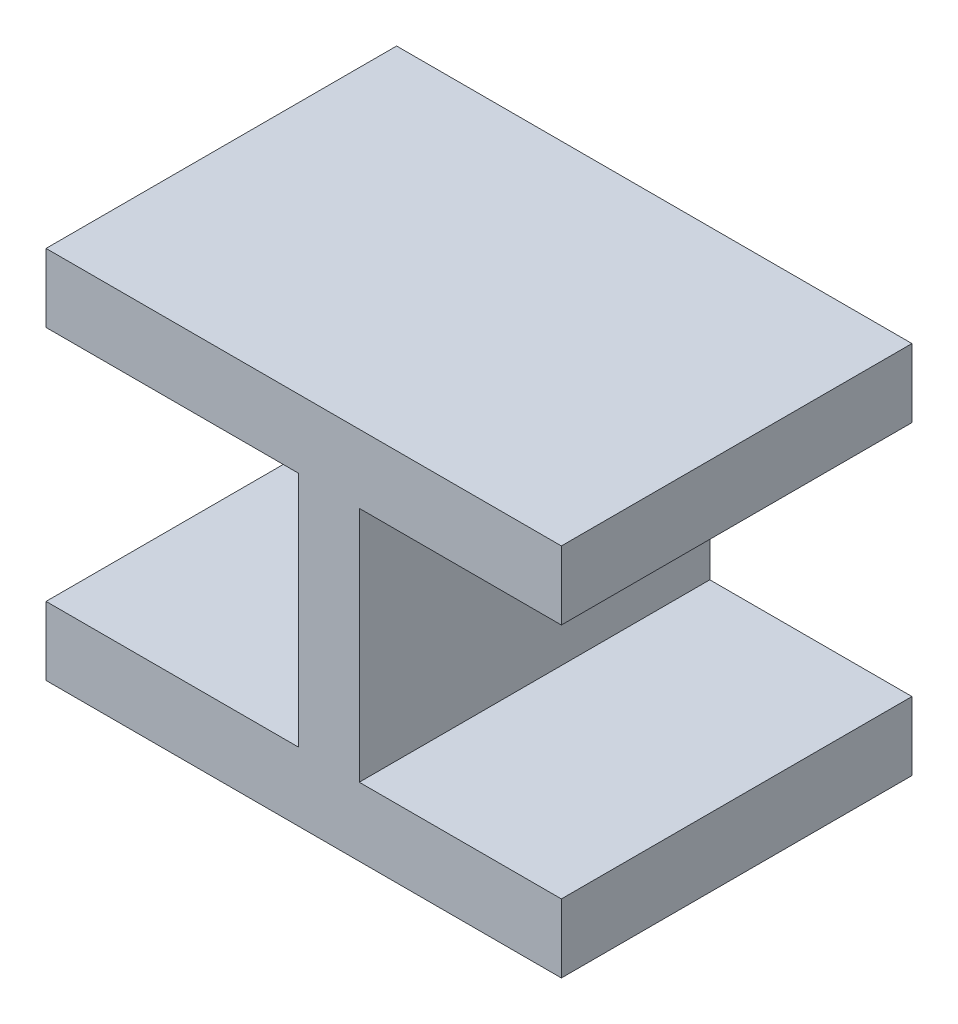
ISO-10303-21;
HEADER;
FILE_DESCRIPTION(('STEP AP214'),'2;1');
FILE_NAME('part.step','',(''),(''),'','','');
FILE_SCHEMA(('AUTOMOTIVE_DESIGN { 1 0 10303 214 1 1 1 1 }'));
ENDSEC;
DATA;
#1=APPLICATION_CONTEXT('core data for automotive mechanical design processes');
#2=APPLICATION_PROTOCOL_DEFINITION('international standard','automotive_design',2000,#1);
#3=PRODUCT_CONTEXT('',#1,'mechanical');
#4=PRODUCT('Part','Part','',(#3));
#5=PRODUCT_RELATED_PRODUCT_CATEGORY('part','',(#4));
#6=PRODUCT_DEFINITION_FORMATION('','',#4);
#7=PRODUCT_DEFINITION_CONTEXT('part definition',#1,'design');
#8=PRODUCT_DEFINITION('design','',#6,#7);
#9=PRODUCT_DEFINITION_SHAPE('','',#8);
#10=(LENGTH_UNIT() NAMED_UNIT(*) SI_UNIT(.MILLI.,.METRE.));
#11=(NAMED_UNIT(*) PLANE_ANGLE_UNIT() SI_UNIT($,.RADIAN.));
#12=(NAMED_UNIT(*) SI_UNIT($,.STERADIAN.) SOLID_ANGLE_UNIT());
#13=UNCERTAINTY_MEASURE_WITH_UNIT(LENGTH_MEASURE(1.E-05),#10,'distance_accuracy_value','');
#14=(GEOMETRIC_REPRESENTATION_CONTEXT(3) GLOBAL_UNCERTAINTY_ASSIGNED_CONTEXT((#13)) GLOBAL_UNIT_ASSIGNED_CONTEXT((#10,
#11,#12)) REPRESENTATION_CONTEXT('',''));
#15=CARTESIAN_POINT('',(0.,0.,0.));
#16=DIRECTION('',(0.,0.,1.));
#17=DIRECTION('',(1.,0.,0.));
#18=AXIS2_PLACEMENT_3D('',#15,#16,#17);
#19=CARTESIAN_POINT('',(-0.126387081674178,-1.16299234892704,0.));
#20=DIRECTION('',(0.,1.,0.));
#21=DIRECTION('',(-1.,0.,0.));
#22=AXIS2_PLACEMENT_3D('',#19,#20,#21);
#23=PLANE('',#22);
#24=DIRECTION('',(1.,0.,0.));
#25=VECTOR('',#24,1.);
#26=CARTESIAN_POINT('',(-0.19833846471974,-1.16299234892705,0.));
#27=LINE('',#26,#25);
#28=CARTESIAN_POINT('',(-0.19833846471974,-1.16299234892705,0.));
#29=VERTEX_POINT('',#28);
#30=CARTESIAN_POINT('',(-0.126387081674178,-1.16299234892704,0.));
#31=VERTEX_POINT('',#30);
#32=EDGE_CURVE('E11',#29,#31,#27,.T.);
#33=ORIENTED_EDGE('',*,*,#32,.F.);
#34=DIRECTION('',(0.,0.,1.));
#35=VECTOR('',#34,1.);
#36=CARTESIAN_POINT('',(-0.19833846471974,-1.16299234892705,0.));
#37=LINE('',#36,#35);
#38=CARTESIAN_POINT('',(-0.19833846471974,-1.16299234892705,0.1));
#39=VERTEX_POINT('',#38);
#40=EDGE_CURVE('E201',#29,#39,#37,.T.);
#41=ORIENTED_EDGE('',*,*,#40,.T.);
#42=DIRECTION('',(-1.,0.,0.));
#43=VECTOR('',#42,1.);
#44=CARTESIAN_POINT('',(-0.126387081674178,-1.16299234892705,0.1));
#45=LINE('',#44,#43);
#46=CARTESIAN_POINT('',(-0.126387081674178,-1.16299234892704,0.1));
#47=VERTEX_POINT('',#46);
#48=EDGE_CURVE('E127',#47,#39,#45,.T.);
#49=ORIENTED_EDGE('',*,*,#48,.F.);
#50=DIRECTION('',(0.,0.,1.));
#51=VECTOR('',#50,1.);
#52=CARTESIAN_POINT('',(-0.126387081674178,-1.16299234892704,0.));
#53=LINE('',#52,#51);
#54=EDGE_CURVE('E196',#31,#47,#53,.T.);
#55=ORIENTED_EDGE('',*,*,#54,.F.);
#56=EDGE_LOOP('',(#33,#41,#49,#55));
#57=FACE_BOUND('',#56,.T.);
#58=ADVANCED_FACE('F17',(#57),#23,.T.);
#59=CARTESIAN_POINT('',(-0.126387081674178,-1.09532945891069,0.));
#60=DIRECTION('',(-1.,0.,0.));
#61=DIRECTION('',(0.,-1.,0.));
#62=AXIS2_PLACEMENT_3D('',#59,#60,#61);
#63=PLANE('',#62);
#64=DIRECTION('',(0.,1.,0.));
#65=VECTOR('',#64,1.);
#66=CARTESIAN_POINT('',(-0.126387081674178,-1.16299234892704,0.));
#67=LINE('',#66,#65);
#68=CARTESIAN_POINT('',(-0.126387081674178,-1.09532945891069,0.));
#69=VERTEX_POINT('',#68);
#70=EDGE_CURVE('E24',#31,#69,#67,.T.);
#71=ORIENTED_EDGE('',*,*,#70,.F.);
#72=ORIENTED_EDGE('',*,*,#54,.T.);
#73=DIRECTION('',(0.,-1.,0.));
#74=VECTOR('',#73,1.);
#75=CARTESIAN_POINT('',(-0.126387081674178,-1.09532945891069,0.1));
#76=LINE('',#75,#74);
#77=CARTESIAN_POINT('',(-0.126387081674178,-1.09532945891069,0.1));
#78=VERTEX_POINT('',#77);
#79=EDGE_CURVE('E188',#78,#47,#76,.T.);
#80=ORIENTED_EDGE('',*,*,#79,.F.);
#81=DIRECTION('',(0.,0.,1.));
#82=VECTOR('',#81,1.);
#83=CARTESIAN_POINT('',(-0.126387081674178,-1.09532945891069,0.));
#84=LINE('',#83,#82);
#85=EDGE_CURVE('E190',#69,#78,#84,.T.);
#86=ORIENTED_EDGE('',*,*,#85,.F.);
#87=EDGE_LOOP('',(#71,#72,#80,#86));
#88=FACE_BOUND('',#87,.T.);
#89=ADVANCED_FACE('F206',(#88),#63,.T.);
#90=CARTESIAN_POINT('',(-0.19833846471974,-1.09532945891069,0.));
#91=DIRECTION('',(0.,-1.,0.));
#92=DIRECTION('',(1.,0.,0.));
#93=AXIS2_PLACEMENT_3D('',#90,#91,#92);
#94=PLANE('',#93);
#95=DIRECTION('',(-1.,0.,0.));
#96=VECTOR('',#95,1.);
#97=CARTESIAN_POINT('',(-0.126387081674178,-1.09532945891069,0.));
#98=LINE('',#97,#96);
#99=CARTESIAN_POINT('',(-0.19833846471974,-1.09532945891069,0.));
#100=VERTEX_POINT('',#99);
#101=EDGE_CURVE('E198',#69,#100,#98,.T.);
#102=ORIENTED_EDGE('',*,*,#101,.F.);
#103=ORIENTED_EDGE('',*,*,#85,.T.);
#104=DIRECTION('',(1.,0.,0.));
#105=VECTOR('',#104,1.);
#106=CARTESIAN_POINT('',(-0.19833846471974,-1.09532945891069,0.1));
#107=LINE('',#106,#105);
#108=CARTESIAN_POINT('',(-0.19833846471974,-1.09532945891069,0.1));
#109=VERTEX_POINT('',#108);
#110=EDGE_CURVE('E180',#109,#78,#107,.T.);
#111=ORIENTED_EDGE('',*,*,#110,.F.);
#112=DIRECTION('',(0.,0.,1.));
#113=VECTOR('',#112,1.);
#114=CARTESIAN_POINT('',(-0.19833846471974,-1.09532945891069,0.));
#115=LINE('',#114,#113);
#116=EDGE_CURVE('E183',#100,#109,#115,.T.);
#117=ORIENTED_EDGE('',*,*,#116,.F.);
#118=EDGE_LOOP('',(#102,#103,#111,#117));
#119=FACE_BOUND('',#118,.T.);
#120=ADVANCED_FACE('F208',(#119),#94,.T.);
#121=CARTESIAN_POINT('',(-0.19833846471974,-1.07579299066653,0.));
#122=DIRECTION('',(-1.,0.,0.));
#123=DIRECTION('',(0.,-1.,0.));
#124=AXIS2_PLACEMENT_3D('',#121,#122,#123);
#125=PLANE('',#124);
#126=DIRECTION('',(0.,1.,0.));
#127=VECTOR('',#126,1.);
#128=CARTESIAN_POINT('',(-0.19833846471974,-1.09532945891069,0.));
#129=LINE('',#128,#127);
#130=CARTESIAN_POINT('',(-0.19833846471974,-1.07579299066653,0.));
#131=VERTEX_POINT('',#130);
#132=EDGE_CURVE('E192',#100,#131,#129,.T.);
#133=ORIENTED_EDGE('',*,*,#132,.F.);
#134=ORIENTED_EDGE('',*,*,#116,.T.);
#135=DIRECTION('',(0.,-1.,0.));
#136=VECTOR('',#135,1.);
#137=CARTESIAN_POINT('',(-0.19833846471974,-1.07579299066653,0.1));
#138=LINE('',#137,#136);
#139=CARTESIAN_POINT('',(-0.19833846471974,-1.07579299066653,0.1));
#140=VERTEX_POINT('',#139);
#141=EDGE_CURVE('E172',#140,#109,#138,.T.);
#142=ORIENTED_EDGE('',*,*,#141,.F.);
#143=DIRECTION('',(0.,0.,1.));
#144=VECTOR('',#143,1.);
#145=CARTESIAN_POINT('',(-0.19833846471974,-1.07579299066653,0.));
#146=LINE('',#145,#144);
#147=EDGE_CURVE('E175',#131,#140,#146,.T.);
#148=ORIENTED_EDGE('',*,*,#147,.F.);
#149=EDGE_LOOP('',(#133,#134,#142,#148));
#150=FACE_BOUND('',#149,.T.);
#151=ADVANCED_FACE('F212',(#150),#125,.T.);
#152=CARTESIAN_POINT('',(-0.0513384536630784,-1.07579299066653,0.));
#153=DIRECTION('',(0.,1.,0.));
#154=DIRECTION('',(-1.,0.,0.));
#155=AXIS2_PLACEMENT_3D('',#152,#153,#154);
#156=PLANE('',#155);
#157=DIRECTION('',(1.,0.,0.));
#158=VECTOR('',#157,1.);
#159=CARTESIAN_POINT('',(-0.19833846471974,-1.07579299066653,0.));
#160=LINE('',#159,#158);
#161=CARTESIAN_POINT('',(-0.0513384536630784,-1.07579299066653,0.));
#162=VERTEX_POINT('',#161);
#163=EDGE_CURVE('E185',#131,#162,#160,.T.);
#164=ORIENTED_EDGE('',*,*,#163,.F.);
#165=ORIENTED_EDGE('',*,*,#147,.T.);
#166=DIRECTION('',(-1.,0.,0.));
#167=VECTOR('',#166,1.);
#168=CARTESIAN_POINT('',(-0.0513384536630784,-1.07579299066653,0.1));
#169=LINE('',#168,#167);
#170=CARTESIAN_POINT('',(-0.0513384536630784,-1.07579299066653,0.1));
#171=VERTEX_POINT('',#170);
#172=EDGE_CURVE('E164',#171,#140,#169,.T.);
#173=ORIENTED_EDGE('',*,*,#172,.F.);
#174=DIRECTION('',(0.,0.,1.));
#175=VECTOR('',#174,1.);
#176=CARTESIAN_POINT('',(-0.0513384536630784,-1.07579299066653,0.));
#177=LINE('',#176,#175);
#178=EDGE_CURVE('E167',#162,#171,#177,.T.);
#179=ORIENTED_EDGE('',*,*,#178,.F.);
#180=EDGE_LOOP('',(#164,#165,#173,#179));
#181=FACE_BOUND('',#180,.T.);
#182=ADVANCED_FACE('F216',(#181),#156,.T.);
#183=CARTESIAN_POINT('',(-0.0513384536630784,-1.09532945891069,0.));
#184=DIRECTION('',(1.,0.,0.));
#185=DIRECTION('',(0.,1.,0.));
#186=AXIS2_PLACEMENT_3D('',#183,#184,#185);
#187=PLANE('',#186);
#188=DIRECTION('',(0.,-1.,0.));
#189=VECTOR('',#188,1.);
#190=CARTESIAN_POINT('',(-0.0513384536630784,-1.07579299066653,0.));
#191=LINE('',#190,#189);
#192=CARTESIAN_POINT('',(-0.0513384536630784,-1.09532945891069,0.));
#193=VERTEX_POINT('',#192);
#194=EDGE_CURVE('E177',#162,#193,#191,.T.);
#195=ORIENTED_EDGE('',*,*,#194,.F.);
#196=ORIENTED_EDGE('',*,*,#178,.T.);
#197=DIRECTION('',(0.,1.,0.));
#198=VECTOR('',#197,1.);
#199=CARTESIAN_POINT('',(-0.0513384536630783,-1.09532945891069,0.1));
#200=LINE('',#199,#198);
#201=CARTESIAN_POINT('',(-0.0513384536630784,-1.09532945891069,0.1));
#202=VERTEX_POINT('',#201);
#203=EDGE_CURVE('E156',#202,#171,#200,.T.);
#204=ORIENTED_EDGE('',*,*,#203,.F.);
#205=DIRECTION('',(0.,0.,1.));
#206=VECTOR('',#205,1.);
#207=CARTESIAN_POINT('',(-0.0513384536630784,-1.09532945891069,0.));
#208=LINE('',#207,#206);
#209=EDGE_CURVE('E159',#193,#202,#208,.T.);
#210=ORIENTED_EDGE('',*,*,#209,.F.);
#211=EDGE_LOOP('',(#195,#196,#204,#210));
#212=FACE_BOUND('',#211,.T.);
#213=ADVANCED_FACE('F220',(#212),#187,.T.);
#214=CARTESIAN_POINT('',(-0.108994859944622,-1.09532945891069,0.));
#215=DIRECTION('',(0.,-1.,0.));
#216=DIRECTION('',(1.,0.,0.));
#217=AXIS2_PLACEMENT_3D('',#214,#215,#216);
#218=PLANE('',#217);
#219=DIRECTION('',(-1.,0.,0.));
#220=VECTOR('',#219,1.);
#221=CARTESIAN_POINT('',(-0.0513384536630784,-1.09532945891069,0.));
#222=LINE('',#221,#220);
#223=CARTESIAN_POINT('',(-0.108994859944622,-1.09532945891069,0.));
#224=VERTEX_POINT('',#223);
#225=EDGE_CURVE('E169',#193,#224,#222,.T.);
#226=ORIENTED_EDGE('',*,*,#225,.F.);
#227=ORIENTED_EDGE('',*,*,#209,.T.);
#228=DIRECTION('',(1.,0.,0.));
#229=VECTOR('',#228,1.);
#230=CARTESIAN_POINT('',(-0.108994859944622,-1.09532945891069,0.1));
#231=LINE('',#230,#229);
#232=CARTESIAN_POINT('',(-0.108994859944622,-1.09532945891069,0.1));
#233=VERTEX_POINT('',#232);
#234=EDGE_CURVE('E148',#233,#202,#231,.T.);
#235=ORIENTED_EDGE('',*,*,#234,.F.);
#236=DIRECTION('',(0.,0.,1.));
#237=VECTOR('',#236,1.);
#238=CARTESIAN_POINT('',(-0.108994859944622,-1.09532945891069,0.));
#239=LINE('',#238,#237);
#240=EDGE_CURVE('E151',#224,#233,#239,.T.);
#241=ORIENTED_EDGE('',*,*,#240,.F.);
#242=EDGE_LOOP('',(#226,#227,#235,#241));
#243=FACE_BOUND('',#242,.T.);
#244=ADVANCED_FACE('F224',(#243),#218,.T.);
#245=CARTESIAN_POINT('',(-0.108994859944621,-1.16299234892704,0.));
#246=DIRECTION('',(1.,0.,0.));
#247=DIRECTION('',(0.,1.,0.));
#248=AXIS2_PLACEMENT_3D('',#245,#246,#247);
#249=PLANE('',#248);
#250=DIRECTION('',(0.,-1.,0.));
#251=VECTOR('',#250,1.);
#252=CARTESIAN_POINT('',(-0.108994859944622,-1.09532945891069,0.));
#253=LINE('',#252,#251);
#254=CARTESIAN_POINT('',(-0.108994859944621,-1.16299234892704,0.));
#255=VERTEX_POINT('',#254);
#256=EDGE_CURVE('E161',#224,#255,#253,.T.);
#257=ORIENTED_EDGE('',*,*,#256,.F.);
#258=ORIENTED_EDGE('',*,*,#240,.T.);
#259=DIRECTION('',(0.,1.,0.));
#260=VECTOR('',#259,1.);
#261=CARTESIAN_POINT('',(-0.108994859944622,-1.16299234892704,0.1));
#262=LINE('',#261,#260);
#263=CARTESIAN_POINT('',(-0.108994859944621,-1.16299234892704,0.1));
#264=VERTEX_POINT('',#263);
#265=EDGE_CURVE('E140',#264,#233,#262,.T.);
#266=ORIENTED_EDGE('',*,*,#265,.F.);
#267=DIRECTION('',(0.,0.,1.));
#268=VECTOR('',#267,1.);
#269=CARTESIAN_POINT('',(-0.108994859944621,-1.16299234892704,0.));
#270=LINE('',#269,#268);
#271=EDGE_CURVE('E143',#255,#264,#270,.T.);
#272=ORIENTED_EDGE('',*,*,#271,.F.);
#273=EDGE_LOOP('',(#257,#258,#266,#272));
#274=FACE_BOUND('',#273,.T.);
#275=ADVANCED_FACE('F228',(#274),#249,.T.);
#276=CARTESIAN_POINT('',(-0.0513384536630782,-1.16299234892704,0.));
#277=DIRECTION('',(0.,1.,0.));
#278=DIRECTION('',(-1.,0.,0.));
#279=AXIS2_PLACEMENT_3D('',#276,#277,#278);
#280=PLANE('',#279);
#281=DIRECTION('',(1.,0.,0.));
#282=VECTOR('',#281,1.);
#283=CARTESIAN_POINT('',(-0.108994859944621,-1.16299234892704,0.));
#284=LINE('',#283,#282);
#285=CARTESIAN_POINT('',(-0.0513384536630782,-1.16299234892704,0.));
#286=VERTEX_POINT('',#285);
#287=EDGE_CURVE('E153',#255,#286,#284,.T.);
#288=ORIENTED_EDGE('',*,*,#287,.F.);
#289=ORIENTED_EDGE('',*,*,#271,.T.);
#290=DIRECTION('',(-1.,0.,0.));
#291=VECTOR('',#290,1.);
#292=CARTESIAN_POINT('',(-0.0513384536630782,-1.16299234892704,0.1));
#293=LINE('',#292,#291);
#294=CARTESIAN_POINT('',(-0.0513384536630782,-1.16299234892704,0.1));
#295=VERTEX_POINT('',#294);
#296=EDGE_CURVE('E133',#295,#264,#293,.T.);
#297=ORIENTED_EDGE('',*,*,#296,.F.);
#298=DIRECTION('',(0.,0.,1.));
#299=VECTOR('',#298,1.);
#300=CARTESIAN_POINT('',(-0.0513384536630782,-1.16299234892704,0.));
#301=LINE('',#300,#299);
#302=EDGE_CURVE('E136',#286,#295,#301,.T.);
#303=ORIENTED_EDGE('',*,*,#302,.F.);
#304=EDGE_LOOP('',(#288,#289,#297,#303));
#305=FACE_BOUND('',#304,.T.);
#306=ADVANCED_FACE('F232',(#305),#280,.T.);
#307=CARTESIAN_POINT('',(-0.0513384536630782,-1.1825288171712,0.));
#308=DIRECTION('',(1.,0.,0.));
#309=DIRECTION('',(0.,1.,0.));
#310=AXIS2_PLACEMENT_3D('',#307,#308,#309);
#311=PLANE('',#310);
#312=DIRECTION('',(0.,-1.,0.));
#313=VECTOR('',#312,1.);
#314=CARTESIAN_POINT('',(-0.0513384536630782,-1.16299234892704,0.));
#315=LINE('',#314,#313);
#316=CARTESIAN_POINT('',(-0.0513384536630782,-1.1825288171712,0.));
#317=VERTEX_POINT('',#316);
#318=EDGE_CURVE('E145',#286,#317,#315,.T.);
#319=ORIENTED_EDGE('',*,*,#318,.F.);
#320=ORIENTED_EDGE('',*,*,#302,.T.);
#321=DIRECTION('',(0.,1.,0.));
#322=VECTOR('',#321,1.);
#323=CARTESIAN_POINT('',(-0.0513384536630781,-1.1825288171712,0.1));
#324=LINE('',#323,#322);
#325=CARTESIAN_POINT('',(-0.0513384536630782,-1.1825288171712,0.1));
#326=VERTEX_POINT('',#325);
#327=EDGE_CURVE('E113',#326,#295,#324,.T.);
#328=ORIENTED_EDGE('',*,*,#327,.F.);
#329=DIRECTION('',(0.,0.,1.));
#330=VECTOR('',#329,1.);
#331=CARTESIAN_POINT('',(-0.0513384536630782,-1.1825288171712,0.));
#332=LINE('',#331,#330);
#333=EDGE_CURVE('E119',#317,#326,#332,.T.);
#334=ORIENTED_EDGE('',*,*,#333,.F.);
#335=EDGE_LOOP('',(#319,#320,#328,#334));
#336=FACE_BOUND('',#335,.T.);
#337=ADVANCED_FACE('F235',(#336),#311,.T.);
#338=CARTESIAN_POINT('',(-0.19833846471974,-1.1825288171712,0.));
#339=DIRECTION('',(0.,-1.,0.));
#340=DIRECTION('',(1.,0.,0.));
#341=AXIS2_PLACEMENT_3D('',#338,#339,#340);
#342=PLANE('',#341);
#343=DIRECTION('',(-1.,0.,0.));
#344=VECTOR('',#343,1.);
#345=CARTESIAN_POINT('',(-0.0513384536630782,-1.1825288171712,0.));
#346=LINE('',#345,#344);
#347=CARTESIAN_POINT('',(-0.19833846471974,-1.1825288171712,0.));
#348=VERTEX_POINT('',#347);
#349=EDGE_CURVE('E138',#317,#348,#346,.T.);
#350=ORIENTED_EDGE('',*,*,#349,.F.);
#351=ORIENTED_EDGE('',*,*,#333,.T.);
#352=DIRECTION('',(1.,0.,0.));
#353=VECTOR('',#352,1.);
#354=CARTESIAN_POINT('',(-0.19833846471974,-1.1825288171712,0.1));
#355=LINE('',#354,#353);
#356=CARTESIAN_POINT('',(-0.19833846471974,-1.1825288171712,0.1));
#357=VERTEX_POINT('',#356);
#358=EDGE_CURVE('E114',#357,#326,#355,.T.);
#359=ORIENTED_EDGE('',*,*,#358,.F.);
#360=DIRECTION('',(0.,0.,1.));
#361=VECTOR('',#360,1.);
#362=CARTESIAN_POINT('',(-0.19833846471974,-1.1825288171712,0.));
#363=LINE('',#362,#361);
#364=EDGE_CURVE('E103',#348,#357,#363,.T.);
#365=ORIENTED_EDGE('',*,*,#364,.F.);
#366=EDGE_LOOP('',(#350,#351,#359,#365));
#367=FACE_BOUND('',#366,.T.);
#368=ADVANCED_FACE('F117',(#367),#342,.T.);
#369=CARTESIAN_POINT('',(-0.19833846471974,-1.16299234892705,0.));
#370=DIRECTION('',(-1.,0.,0.));
#371=DIRECTION('',(0.,-1.,0.));
#372=AXIS2_PLACEMENT_3D('',#369,#370,#371);
#373=PLANE('',#372);
#374=DIRECTION('',(0.,1.,0.));
#375=VECTOR('',#374,1.);
#376=CARTESIAN_POINT('',(-0.19833846471974,-1.1825288171712,0.));
#377=LINE('',#376,#375);
#378=EDGE_CURVE('E110',#348,#29,#377,.T.);
#379=ORIENTED_EDGE('',*,*,#378,.F.);
#380=ORIENTED_EDGE('',*,*,#364,.T.);
#381=DIRECTION('',(0.,-1.,0.));
#382=VECTOR('',#381,1.);
#383=CARTESIAN_POINT('',(-0.19833846471974,-1.16299234892705,0.1));
#384=LINE('',#383,#382);
#385=EDGE_CURVE('E108',#39,#357,#384,.T.);
#386=ORIENTED_EDGE('',*,*,#385,.F.);
#387=ORIENTED_EDGE('',*,*,#40,.F.);
#388=EDGE_LOOP('',(#379,#380,#386,#387));
#389=FACE_BOUND('',#388,.T.);
#390=ADVANCED_FACE('F105',(#389),#373,.T.);
#391=CARTESIAN_POINT('',(-0.123901156488734,-1.12916090391887,0.));
#392=DIRECTION('',(0.,0.,1.));
#393=DIRECTION('',(1.,0.,0.));
#394=AXIS2_PLACEMENT_3D('',#391,#392,#393);
#395=PLANE('',#394);
#396=ORIENTED_EDGE('',*,*,#378,.T.);
#397=ORIENTED_EDGE('',*,*,#32,.T.);
#398=ORIENTED_EDGE('',*,*,#70,.T.);
#399=ORIENTED_EDGE('',*,*,#101,.T.);
#400=ORIENTED_EDGE('',*,*,#132,.T.);
#401=ORIENTED_EDGE('',*,*,#163,.T.);
#402=ORIENTED_EDGE('',*,*,#194,.T.);
#403=ORIENTED_EDGE('',*,*,#225,.T.);
#404=ORIENTED_EDGE('',*,*,#256,.T.);
#405=ORIENTED_EDGE('',*,*,#287,.T.);
#406=ORIENTED_EDGE('',*,*,#318,.T.);
#407=ORIENTED_EDGE('',*,*,#349,.T.);
#408=EDGE_LOOP('',(#396,#397,#398,#399,#400,#401,#402,#403,#404,#405,#406,#407));
#409=FACE_BOUND('',#408,.T.);
#410=ADVANCED_FACE('F203',(#409),#395,.F.);
#411=CARTESIAN_POINT('',(-0.123901156488734,-1.12916090391887,0.1));
#412=DIRECTION('',(0.,0.,1.));
#413=DIRECTION('',(1.,0.,0.));
#414=AXIS2_PLACEMENT_3D('',#411,#412,#413);
#415=PLANE('',#414);
#416=ORIENTED_EDGE('',*,*,#385,.T.);
#417=ORIENTED_EDGE('',*,*,#358,.T.);
#418=ORIENTED_EDGE('',*,*,#327,.T.);
#419=ORIENTED_EDGE('',*,*,#296,.T.);
#420=ORIENTED_EDGE('',*,*,#265,.T.);
#421=ORIENTED_EDGE('',*,*,#234,.T.);
#422=ORIENTED_EDGE('',*,*,#203,.T.);
#423=ORIENTED_EDGE('',*,*,#172,.T.);
#424=ORIENTED_EDGE('',*,*,#141,.T.);
#425=ORIENTED_EDGE('',*,*,#110,.T.);
#426=ORIENTED_EDGE('',*,*,#79,.T.);
#427=ORIENTED_EDGE('',*,*,#48,.T.);
#428=EDGE_LOOP('',(#416,#417,#418,#419,#420,#421,#422,#423,#424,#425,#426,#427));
#429=FACE_BOUND('',#428,.T.);
#430=ADVANCED_FACE('F124',(#429),#415,.T.);
#431=CLOSED_SHELL('',(#58,#89,#120,#151,#182,#213,#244,#275,#306,#337,#368,#390,#410,#430));
#432=MANIFOLD_SOLID_BREP('B1',#431);
#433=ADVANCED_BREP_SHAPE_REPRESENTATION('',(#18,#432),#14);
#434=SHAPE_DEFINITION_REPRESENTATION(#9,#433);
ENDSEC;
END-ISO-10303-21;
